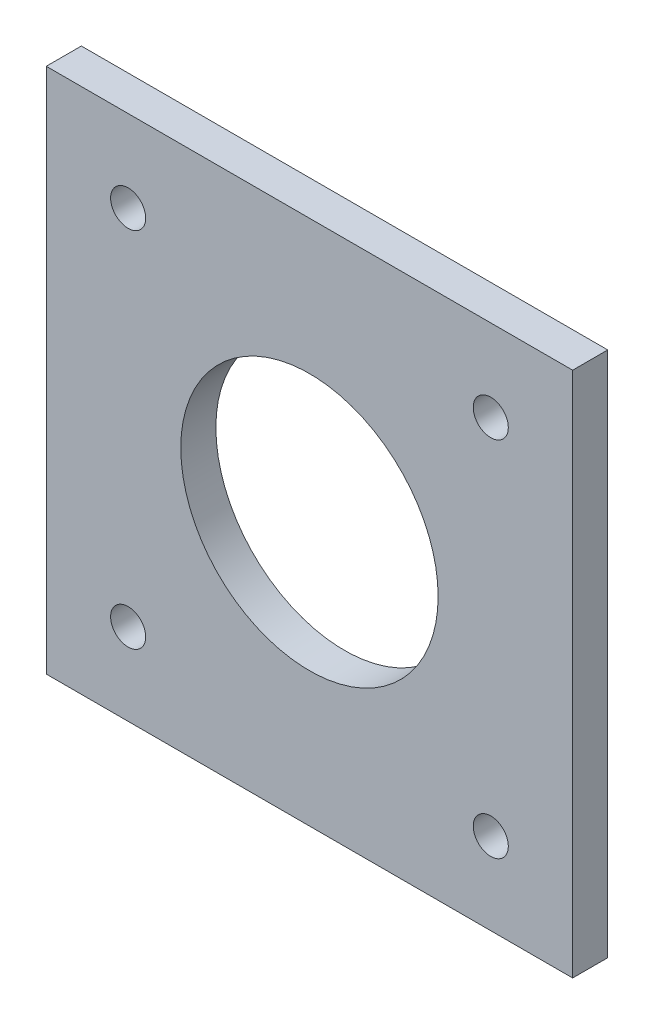
ISO-10303-21;
HEADER;
FILE_DESCRIPTION(('STEP AP214'),'2;1');
FILE_NAME('part.step','',(''),(''),'','','');
FILE_SCHEMA(('AUTOMOTIVE_DESIGN { 1 0 10303 214 1 1 1 1 }'));
ENDSEC;
DATA;
#1=APPLICATION_CONTEXT('core data for automotive mechanical design processes');
#2=APPLICATION_PROTOCOL_DEFINITION('international standard','automotive_design',2000,#1);
#3=PRODUCT_CONTEXT('',#1,'mechanical');
#4=PRODUCT('Part','Part','',(#3));
#5=PRODUCT_RELATED_PRODUCT_CATEGORY('part','',(#4));
#6=PRODUCT_DEFINITION_FORMATION('','',#4);
#7=PRODUCT_DEFINITION_CONTEXT('part definition',#1,'design');
#8=PRODUCT_DEFINITION('design','',#6,#7);
#9=PRODUCT_DEFINITION_SHAPE('','',#8);
#10=(LENGTH_UNIT() NAMED_UNIT(*) SI_UNIT(.MILLI.,.METRE.));
#11=(NAMED_UNIT(*) PLANE_ANGLE_UNIT() SI_UNIT($,.RADIAN.));
#12=(NAMED_UNIT(*) SI_UNIT($,.STERADIAN.) SOLID_ANGLE_UNIT());
#13=UNCERTAINTY_MEASURE_WITH_UNIT(LENGTH_MEASURE(1.E-05),#10,'distance_accuracy_value','');
#14=(GEOMETRIC_REPRESENTATION_CONTEXT(3) GLOBAL_UNCERTAINTY_ASSIGNED_CONTEXT((#13)) GLOBAL_UNIT_ASSIGNED_CONTEXT((#10,
#11,#12)) REPRESENTATION_CONTEXT('',''));
#15=CARTESIAN_POINT('',(0.,0.,0.));
#16=DIRECTION('',(0.,0.,1.));
#17=DIRECTION('',(1.,0.,0.));
#18=AXIS2_PLACEMENT_3D('',#15,#16,#17);
#19=CARTESIAN_POINT('',(22.5,0.,3.));
#20=DIRECTION('',(1.,0.,0.));
#21=DIRECTION('',(0.,1.,0.));
#22=AXIS2_PLACEMENT_3D('',#19,#20,#21);
#23=PLANE('',#22);
#24=DIRECTION('',(0.,-1.,0.));
#25=VECTOR('',#24,1.);
#26=CARTESIAN_POINT('',(22.5,0.,0.));
#27=LINE('',#26,#25);
#28=CARTESIAN_POINT('',(22.5,22.5,0.));
#29=VERTEX_POINT('',#28);
#30=CARTESIAN_POINT('',(22.5,-22.5,0.));
#31=VERTEX_POINT('',#30);
#32=EDGE_CURVE('E117',#29,#31,#27,.T.);
#33=ORIENTED_EDGE('',*,*,#32,.F.);
#34=DIRECTION('',(0.,0.,-1.));
#35=VECTOR('',#34,1.);
#36=CARTESIAN_POINT('',(22.5,22.5,3.));
#37=LINE('',#36,#35);
#38=CARTESIAN_POINT('',(22.5,22.5,3.));
#39=VERTEX_POINT('',#38);
#40=EDGE_CURVE('E11',#39,#29,#37,.T.);
#41=ORIENTED_EDGE('',*,*,#40,.F.);
#42=DIRECTION('',(0.,-1.,0.));
#43=VECTOR('',#42,1.);
#44=CARTESIAN_POINT('',(22.5,0.,3.));
#45=LINE('',#44,#43);
#46=CARTESIAN_POINT('',(22.5,-22.5,3.));
#47=VERTEX_POINT('',#46);
#48=EDGE_CURVE('E96',#39,#47,#45,.T.);
#49=ORIENTED_EDGE('',*,*,#48,.T.);
#50=DIRECTION('',(0.,0.,-1.));
#51=VECTOR('',#50,1.);
#52=CARTESIAN_POINT('',(22.5,-22.5,3.));
#53=LINE('',#52,#51);
#54=EDGE_CURVE('E76',#47,#31,#53,.T.);
#55=ORIENTED_EDGE('',*,*,#54,.T.);
#56=EDGE_LOOP('',(#33,#41,#49,#55));
#57=FACE_BOUND('',#56,.T.);
#58=ADVANCED_FACE('F38',(#57),#23,.T.);
#59=CARTESIAN_POINT('',(0.,22.5,3.));
#60=DIRECTION('',(0.,1.,0.));
#61=DIRECTION('',(0.,0.,1.));
#62=AXIS2_PLACEMENT_3D('',#59,#60,#61);
#63=PLANE('',#62);
#64=DIRECTION('',(1.,0.,0.));
#65=VECTOR('',#64,1.);
#66=CARTESIAN_POINT('',(0.,22.5,0.));
#67=LINE('',#66,#65);
#68=CARTESIAN_POINT('',(-22.5,22.5,0.));
#69=VERTEX_POINT('',#68);
#70=EDGE_CURVE('E89',#69,#29,#67,.T.);
#71=ORIENTED_EDGE('',*,*,#70,.F.);
#72=DIRECTION('',(0.,0.,-1.));
#73=VECTOR('',#72,1.);
#74=CARTESIAN_POINT('',(-22.5,22.5,3.));
#75=LINE('',#74,#73);
#76=CARTESIAN_POINT('',(-22.5,22.5,3.));
#77=VERTEX_POINT('',#76);
#78=EDGE_CURVE('E46',#77,#69,#75,.T.);
#79=ORIENTED_EDGE('',*,*,#78,.F.);
#80=DIRECTION('',(1.,0.,0.));
#81=VECTOR('',#80,1.);
#82=CARTESIAN_POINT('',(0.,22.5,3.));
#83=LINE('',#82,#81);
#84=EDGE_CURVE('E87',#77,#39,#83,.T.);
#85=ORIENTED_EDGE('',*,*,#84,.T.);
#86=ORIENTED_EDGE('',*,*,#40,.T.);
#87=EDGE_LOOP('',(#71,#79,#85,#86));
#88=FACE_BOUND('',#87,.T.);
#89=ADVANCED_FACE('F85',(#88),#63,.T.);
#90=CARTESIAN_POINT('',(-22.5,0.,3.));
#91=DIRECTION('',(1.,0.,0.));
#92=DIRECTION('',(0.,1.,0.));
#93=AXIS2_PLACEMENT_3D('',#90,#91,#92);
#94=PLANE('',#93);
#95=DIRECTION('',(0.,-1.,0.));
#96=VECTOR('',#95,1.);
#97=CARTESIAN_POINT('',(-22.5,0.,0.));
#98=LINE('',#97,#96);
#99=CARTESIAN_POINT('',(-22.5,-22.5,0.));
#100=VERTEX_POINT('',#99);
#101=EDGE_CURVE('E69',#69,#100,#98,.T.);
#102=ORIENTED_EDGE('',*,*,#101,.T.);
#103=DIRECTION('',(0.,0.,-1.));
#104=VECTOR('',#103,1.);
#105=CARTESIAN_POINT('',(-22.5,-22.5,3.));
#106=LINE('',#105,#104);
#107=CARTESIAN_POINT('',(-22.5,-22.5,3.));
#108=VERTEX_POINT('',#107);
#109=EDGE_CURVE('E90',#108,#100,#106,.T.);
#110=ORIENTED_EDGE('',*,*,#109,.F.);
#111=DIRECTION('',(0.,-1.,0.));
#112=VECTOR('',#111,1.);
#113=CARTESIAN_POINT('',(-22.5,0.,3.));
#114=LINE('',#113,#112);
#115=EDGE_CURVE('E91',#77,#108,#114,.T.);
#116=ORIENTED_EDGE('',*,*,#115,.F.);
#117=ORIENTED_EDGE('',*,*,#78,.T.);
#118=EDGE_LOOP('',(#102,#110,#116,#117));
#119=FACE_BOUND('',#118,.T.);
#120=ADVANCED_FACE('F92',(#119),#94,.F.);
#121=CARTESIAN_POINT('',(-15.499999999999,-15.5000000000001,3.));
#122=DIRECTION('',(0.,0.,-1.));
#123=DIRECTION('',(-1.,0.,0.));
#124=AXIS2_PLACEMENT_3D('',#121,#122,#123);
#125=CYLINDRICAL_SURFACE('',#124,1.5);
#126=CARTESIAN_POINT('',(-15.499999999999,-15.5000000000001,3.));
#127=DIRECTION('',(0.,0.,1.));
#128=DIRECTION('',(1.,0.,0.));
#129=AXIS2_PLACEMENT_3D('',#126,#127,#128);
#130=CIRCLE('',#129,1.5);
#131=CARTESIAN_POINT('',(-13.999999999999,-15.5000000000001,3.));
#132=VERTEX_POINT('',#131);
#133=EDGE_CURVE('E111',#132,#132,#130,.T.);
#134=ORIENTED_EDGE('',*,*,#133,.T.);
#135=EDGE_LOOP('',(#134));
#136=FACE_BOUND('',#135,.T.);
#137=CARTESIAN_POINT('',(-15.499999999999,-15.5000000000001,0.));
#138=DIRECTION('',(0.,0.,1.));
#139=DIRECTION('',(1.,0.,0.));
#140=AXIS2_PLACEMENT_3D('',#137,#138,#139);
#141=CIRCLE('',#140,1.5);
#142=CARTESIAN_POINT('',(-13.999999999999,-15.5000000000001,0.));
#143=VERTEX_POINT('',#142);
#144=EDGE_CURVE('E133',#143,#143,#141,.T.);
#145=ORIENTED_EDGE('',*,*,#144,.F.);
#146=EDGE_LOOP('',(#145));
#147=FACE_BOUND('',#146,.T.);
#148=ADVANCED_FACE('F152',(#136,#147),#125,.F.);
#149=CARTESIAN_POINT('',(15.4999999999999,15.500000000001,3.));
#150=DIRECTION('',(0.,0.,-1.));
#151=DIRECTION('',(-1.,0.,0.));
#152=AXIS2_PLACEMENT_3D('',#149,#150,#151);
#153=CYLINDRICAL_SURFACE('',#152,1.5);
#154=CARTESIAN_POINT('',(15.4999999999999,15.500000000001,3.));
#155=DIRECTION('',(0.,0.,1.));
#156=DIRECTION('',(1.,0.,0.));
#157=AXIS2_PLACEMENT_3D('',#154,#155,#156);
#158=CIRCLE('',#157,1.5);
#159=CARTESIAN_POINT('',(16.9999999999999,15.500000000001,3.));
#160=VERTEX_POINT('',#159);
#161=EDGE_CURVE('E108',#160,#160,#158,.T.);
#162=ORIENTED_EDGE('',*,*,#161,.T.);
#163=EDGE_LOOP('',(#162));
#164=FACE_BOUND('',#163,.T.);
#165=CARTESIAN_POINT('',(15.4999999999999,15.500000000001,0.));
#166=DIRECTION('',(0.,0.,1.));
#167=DIRECTION('',(1.,0.,0.));
#168=AXIS2_PLACEMENT_3D('',#165,#166,#167);
#169=CIRCLE('',#168,1.5);
#170=CARTESIAN_POINT('',(16.9999999999999,15.500000000001,0.));
#171=VERTEX_POINT('',#170);
#172=EDGE_CURVE('E130',#171,#171,#169,.T.);
#173=ORIENTED_EDGE('',*,*,#172,.F.);
#174=EDGE_LOOP('',(#173));
#175=FACE_BOUND('',#174,.T.);
#176=ADVANCED_FACE('F165',(#164,#175),#153,.F.);
#177=CARTESIAN_POINT('',(15.500000000001,-15.499999999999,3.));
#178=DIRECTION('',(0.,0.,-1.));
#179=DIRECTION('',(-1.,0.,0.));
#180=AXIS2_PLACEMENT_3D('',#177,#178,#179);
#181=CYLINDRICAL_SURFACE('',#180,1.5);
#182=CARTESIAN_POINT('',(15.500000000001,-15.499999999999,3.));
#183=DIRECTION('',(0.,0.,1.));
#184=DIRECTION('',(1.,0.,0.));
#185=AXIS2_PLACEMENT_3D('',#182,#183,#184);
#186=CIRCLE('',#185,1.5);
#187=CARTESIAN_POINT('',(17.000000000001,-15.499999999999,3.));
#188=VERTEX_POINT('',#187);
#189=EDGE_CURVE('E105',#188,#188,#186,.T.);
#190=ORIENTED_EDGE('',*,*,#189,.T.);
#191=EDGE_LOOP('',(#190));
#192=FACE_BOUND('',#191,.T.);
#193=CARTESIAN_POINT('',(15.500000000001,-15.499999999999,0.));
#194=DIRECTION('',(0.,0.,1.));
#195=DIRECTION('',(1.,0.,0.));
#196=AXIS2_PLACEMENT_3D('',#193,#194,#195);
#197=CIRCLE('',#196,1.5);
#198=CARTESIAN_POINT('',(17.000000000001,-15.499999999999,0.));
#199=VERTEX_POINT('',#198);
#200=EDGE_CURVE('E127',#199,#199,#197,.T.);
#201=ORIENTED_EDGE('',*,*,#200,.F.);
#202=EDGE_LOOP('',(#201));
#203=FACE_BOUND('',#202,.T.);
#204=ADVANCED_FACE('F161',(#192,#203),#181,.F.);
#205=CARTESIAN_POINT('',(0.,0.,3.));
#206=DIRECTION('',(0.,0.,-1.));
#207=DIRECTION('',(-1.,0.,0.));
#208=AXIS2_PLACEMENT_3D('',#205,#206,#207);
#209=CYLINDRICAL_SURFACE('',#208,11.);
#210=CARTESIAN_POINT('',(0.,0.,3.));
#211=DIRECTION('',(0.,0.,1.));
#212=DIRECTION('',(1.,0.,0.));
#213=AXIS2_PLACEMENT_3D('',#210,#211,#212);
#214=CIRCLE('',#213,11.);
#215=CARTESIAN_POINT('',(11.,0.,3.));
#216=VERTEX_POINT('',#215);
#217=EDGE_CURVE('E102',#216,#216,#214,.T.);
#218=ORIENTED_EDGE('',*,*,#217,.T.);
#219=EDGE_LOOP('',(#218));
#220=FACE_BOUND('',#219,.T.);
#221=CARTESIAN_POINT('',(0.,0.,0.));
#222=DIRECTION('',(0.,0.,1.));
#223=DIRECTION('',(1.,0.,0.));
#224=AXIS2_PLACEMENT_3D('',#221,#222,#223);
#225=CIRCLE('',#224,11.);
#226=CARTESIAN_POINT('',(11.,0.,0.));
#227=VERTEX_POINT('',#226);
#228=EDGE_CURVE('E124',#227,#227,#225,.T.);
#229=ORIENTED_EDGE('',*,*,#228,.F.);
#230=EDGE_LOOP('',(#229));
#231=FACE_BOUND('',#230,.T.);
#232=ADVANCED_FACE('F158',(#220,#231),#209,.F.);
#233=CARTESIAN_POINT('',(0.,-22.5,3.));
#234=DIRECTION('',(0.,1.,0.));
#235=DIRECTION('',(0.,0.,1.));
#236=AXIS2_PLACEMENT_3D('',#233,#234,#235);
#237=PLANE('',#236);
#238=DIRECTION('',(1.,0.,0.));
#239=VECTOR('',#238,1.);
#240=CARTESIAN_POINT('',(0.,-22.5,0.));
#241=LINE('',#240,#239);
#242=EDGE_CURVE('E122',#100,#31,#241,.T.);
#243=ORIENTED_EDGE('',*,*,#242,.T.);
#244=ORIENTED_EDGE('',*,*,#54,.F.);
#245=DIRECTION('',(1.,0.,0.));
#246=VECTOR('',#245,1.);
#247=CARTESIAN_POINT('',(0.,-22.5,3.));
#248=LINE('',#247,#246);
#249=EDGE_CURVE('E54',#108,#47,#248,.T.);
#250=ORIENTED_EDGE('',*,*,#249,.F.);
#251=ORIENTED_EDGE('',*,*,#109,.T.);
#252=EDGE_LOOP('',(#243,#244,#250,#251));
#253=FACE_BOUND('',#252,.T.);
#254=ADVANCED_FACE('F141',(#253),#237,.F.);
#255=CARTESIAN_POINT('',(-15.5000000000001,15.4999999999999,3.));
#256=DIRECTION('',(0.,0.,-1.));
#257=DIRECTION('',(-1.,0.,0.));
#258=AXIS2_PLACEMENT_3D('',#255,#256,#257);
#259=CYLINDRICAL_SURFACE('',#258,1.5);
#260=CARTESIAN_POINT('',(-15.5000000000001,15.4999999999999,3.));
#261=DIRECTION('',(0.,0.,1.));
#262=DIRECTION('',(1.,0.,0.));
#263=AXIS2_PLACEMENT_3D('',#260,#261,#262);
#264=CIRCLE('',#263,1.5);
#265=CARTESIAN_POINT('',(-14.0000000000001,15.4999999999999,3.));
#266=VERTEX_POINT('',#265);
#267=EDGE_CURVE('E114',#266,#266,#264,.T.);
#268=ORIENTED_EDGE('',*,*,#267,.T.);
#269=EDGE_LOOP('',(#268));
#270=FACE_BOUND('',#269,.T.);
#271=CARTESIAN_POINT('',(-15.5000000000001,15.4999999999999,0.));
#272=DIRECTION('',(0.,0.,1.));
#273=DIRECTION('',(1.,0.,0.));
#274=AXIS2_PLACEMENT_3D('',#271,#272,#273);
#275=CIRCLE('',#274,1.5);
#276=CARTESIAN_POINT('',(-14.0000000000001,15.4999999999999,0.));
#277=VERTEX_POINT('',#276);
#278=EDGE_CURVE('E98',#277,#277,#275,.T.);
#279=ORIENTED_EDGE('',*,*,#278,.F.);
#280=EDGE_LOOP('',(#279));
#281=FACE_BOUND('',#280,.T.);
#282=ADVANCED_FACE('F157',(#270,#281),#259,.F.);
#283=CARTESIAN_POINT('',(0.,0.,3.));
#284=DIRECTION('',(0.,0.,1.));
#285=DIRECTION('',(1.,0.,0.));
#286=AXIS2_PLACEMENT_3D('',#283,#284,#285);
#287=PLANE('',#286);
#288=ORIENTED_EDGE('',*,*,#48,.F.);
#289=ORIENTED_EDGE('',*,*,#84,.F.);
#290=ORIENTED_EDGE('',*,*,#115,.T.);
#291=ORIENTED_EDGE('',*,*,#249,.T.);
#292=EDGE_LOOP('',(#288,#289,#290,#291));
#293=FACE_BOUND('',#292,.T.);
#294=ORIENTED_EDGE('',*,*,#217,.F.);
#295=EDGE_LOOP('',(#294));
#296=FACE_BOUND('',#295,.T.);
#297=ORIENTED_EDGE('',*,*,#189,.F.);
#298=EDGE_LOOP('',(#297));
#299=FACE_BOUND('',#298,.T.);
#300=ORIENTED_EDGE('',*,*,#161,.F.);
#301=EDGE_LOOP('',(#300));
#302=FACE_BOUND('',#301,.T.);
#303=ORIENTED_EDGE('',*,*,#133,.F.);
#304=EDGE_LOOP('',(#303));
#305=FACE_BOUND('',#304,.T.);
#306=ORIENTED_EDGE('',*,*,#267,.F.);
#307=EDGE_LOOP('',(#306));
#308=FACE_BOUND('',#307,.T.);
#309=ADVANCED_FACE('F94',(#293,#296,#299,#302,#305,#308),#287,.T.);
#310=CARTESIAN_POINT('',(0.,0.,0.));
#311=DIRECTION('',(0.,0.,1.));
#312=DIRECTION('',(1.,0.,0.));
#313=AXIS2_PLACEMENT_3D('',#310,#311,#312);
#314=PLANE('',#313);
#315=ORIENTED_EDGE('',*,*,#32,.T.);
#316=ORIENTED_EDGE('',*,*,#242,.F.);
#317=ORIENTED_EDGE('',*,*,#101,.F.);
#318=ORIENTED_EDGE('',*,*,#70,.T.);
#319=EDGE_LOOP('',(#315,#316,#317,#318));
#320=FACE_BOUND('',#319,.T.);
#321=ORIENTED_EDGE('',*,*,#228,.T.);
#322=EDGE_LOOP('',(#321));
#323=FACE_BOUND('',#322,.T.);
#324=ORIENTED_EDGE('',*,*,#200,.T.);
#325=EDGE_LOOP('',(#324));
#326=FACE_BOUND('',#325,.T.);
#327=ORIENTED_EDGE('',*,*,#172,.T.);
#328=EDGE_LOOP('',(#327));
#329=FACE_BOUND('',#328,.T.);
#330=ORIENTED_EDGE('',*,*,#144,.T.);
#331=EDGE_LOOP('',(#330));
#332=FACE_BOUND('',#331,.T.);
#333=ORIENTED_EDGE('',*,*,#278,.T.);
#334=EDGE_LOOP('',(#333));
#335=FACE_BOUND('',#334,.T.);
#336=ADVANCED_FACE('F143',(#320,#323,#326,#329,#332,#335),#314,.F.);
#337=CLOSED_SHELL('',(#58,#89,#120,#148,#176,#204,#232,#254,#282,#309,#336));
#338=MANIFOLD_SOLID_BREP('B2',#337);
#339=ADVANCED_BREP_SHAPE_REPRESENTATION('',(#18,#338),#14);
#340=SHAPE_DEFINITION_REPRESENTATION(#9,#339);
ENDSEC;
END-ISO-10303-21;
